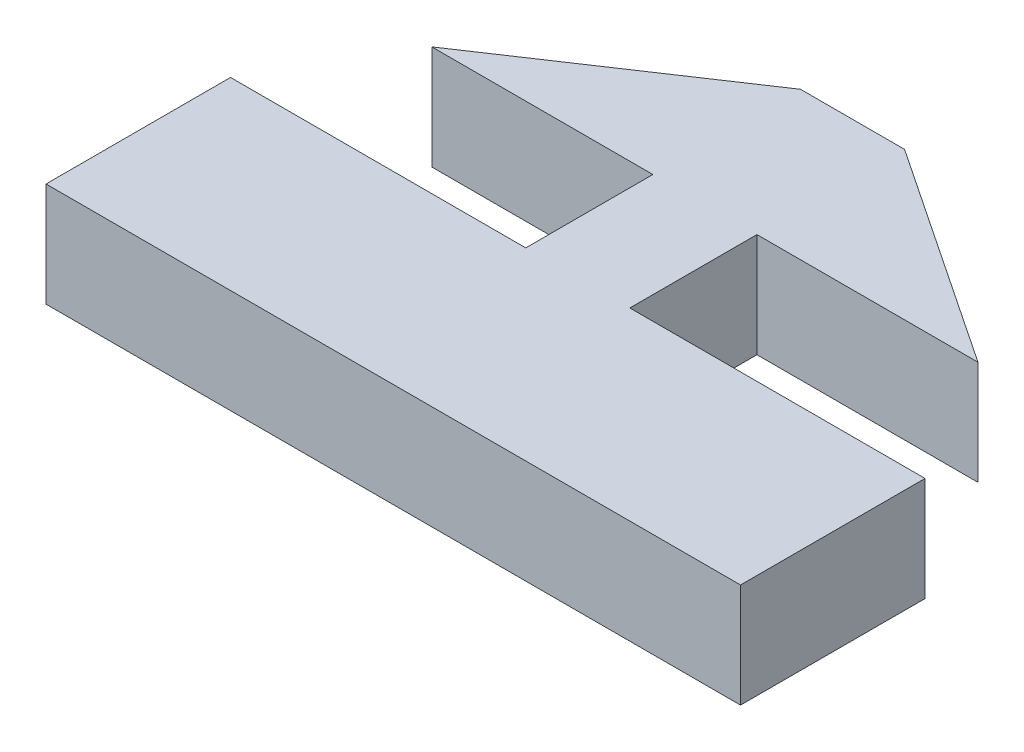
ISO-10303-21;
HEADER;
FILE_DESCRIPTION(('STEP AP214'),'2;1');
FILE_NAME('part.step','',(''),(''),'','','');
FILE_SCHEMA(('AUTOMOTIVE_DESIGN { 1 0 10303 214 1 1 1 1 }'));
ENDSEC;
DATA;
#1=APPLICATION_CONTEXT('core data for automotive mechanical design processes');
#2=APPLICATION_PROTOCOL_DEFINITION('international standard','automotive_design',2000,#1);
#3=PRODUCT_CONTEXT('',#1,'mechanical');
#4=PRODUCT('Part','Part','',(#3));
#5=PRODUCT_RELATED_PRODUCT_CATEGORY('part','',(#4));
#6=PRODUCT_DEFINITION_FORMATION('','',#4);
#7=PRODUCT_DEFINITION_CONTEXT('part definition',#1,'design');
#8=PRODUCT_DEFINITION('design','',#6,#7);
#9=PRODUCT_DEFINITION_SHAPE('','',#8);
#10=(LENGTH_UNIT() NAMED_UNIT(*) SI_UNIT(.MILLI.,.METRE.));
#11=(NAMED_UNIT(*) PLANE_ANGLE_UNIT() SI_UNIT($,.RADIAN.));
#12=(NAMED_UNIT(*) SI_UNIT($,.STERADIAN.) SOLID_ANGLE_UNIT());
#13=UNCERTAINTY_MEASURE_WITH_UNIT(LENGTH_MEASURE(1.E-05),#10,'distance_accuracy_value','');
#14=(GEOMETRIC_REPRESENTATION_CONTEXT(3) GLOBAL_UNCERTAINTY_ASSIGNED_CONTEXT((#13)) GLOBAL_UNIT_ASSIGNED_CONTEXT((#10,
#11,#12)) REPRESENTATION_CONTEXT('',''));
#15=CARTESIAN_POINT('',(0.,0.,0.));
#16=DIRECTION('',(0.,0.,1.));
#17=DIRECTION('',(1.,0.,0.));
#18=AXIS2_PLACEMENT_3D('',#15,#16,#17);
#19=CARTESIAN_POINT('',(0.,3.5814,8.5374988));
#20=DIRECTION('',(0.,0.,-1.));
#21=DIRECTION('',(-1.,0.,0.));
#22=AXIS2_PLACEMENT_3D('',#19,#20,#21);
#23=PLANE('',#22);
#24=DIRECTION('',(1.,0.,0.));
#25=VECTOR('',#24,1.);
#26=CARTESIAN_POINT('',(0.,0.,8.5374988));
#27=LINE('',#26,#25);
#28=CARTESIAN_POINT('',(-11.9507,0.,8.5374988));
#29=VERTEX_POINT('',#28);
#30=CARTESIAN_POINT('',(11.9507,0.,8.5374988));
#31=VERTEX_POINT('',#30);
#32=EDGE_CURVE('E156',#29,#31,#27,.T.);
#33=ORIENTED_EDGE('',*,*,#32,.T.);
#34=DIRECTION('',(0.,-1.,0.));
#35=VECTOR('',#34,1.);
#36=CARTESIAN_POINT('',(11.9507,3.5814,8.5374988));
#37=LINE('',#36,#35);
#38=CARTESIAN_POINT('',(11.9507,3.5814,8.5374988));
#39=VERTEX_POINT('',#38);
#40=EDGE_CURVE('E11',#39,#31,#37,.T.);
#41=ORIENTED_EDGE('',*,*,#40,.F.);
#42=DIRECTION('',(1.,0.,0.));
#43=VECTOR('',#42,1.);
#44=CARTESIAN_POINT('',(0.,3.5814,8.5374988));
#45=LINE('',#44,#43);
#46=CARTESIAN_POINT('',(-11.9507,3.5814,8.5374988));
#47=VERTEX_POINT('',#46);
#48=EDGE_CURVE('E186',#47,#39,#45,.T.);
#49=ORIENTED_EDGE('',*,*,#48,.F.);
#50=DIRECTION('',(0.,-1.,0.));
#51=VECTOR('',#50,1.);
#52=CARTESIAN_POINT('',(-11.9507,3.5814,8.5374988));
#53=LINE('',#52,#51);
#54=EDGE_CURVE('E155',#47,#29,#53,.T.);
#55=ORIENTED_EDGE('',*,*,#54,.T.);
#56=EDGE_LOOP('',(#33,#41,#49,#55));
#57=FACE_BOUND('',#56,.T.);
#58=ADVANCED_FACE('F34',(#57),#23,.F.);
#59=CARTESIAN_POINT('',(11.9507,3.5814,0.));
#60=DIRECTION('',(-1.,0.,0.));
#61=DIRECTION('',(0.,0.,1.));
#62=AXIS2_PLACEMENT_3D('',#59,#60,#61);
#63=PLANE('',#62);
#64=DIRECTION('',(0.,0.,-1.));
#65=VECTOR('',#64,1.);
#66=CARTESIAN_POINT('',(11.9507,0.,0.));
#67=LINE('',#66,#65);
#68=CARTESIAN_POINT('',(11.9507,0.,2.1874988));
#69=VERTEX_POINT('',#68);
#70=EDGE_CURVE('E159',#31,#69,#67,.T.);
#71=ORIENTED_EDGE('',*,*,#70,.T.);
#72=DIRECTION('',(0.,-1.,0.));
#73=VECTOR('',#72,1.);
#74=CARTESIAN_POINT('',(11.9507,3.5814,2.1874988));
#75=LINE('',#74,#73);
#76=CARTESIAN_POINT('',(11.9507,3.5814,2.1874988));
#77=VERTEX_POINT('',#76);
#78=EDGE_CURVE('E42',#77,#69,#75,.T.);
#79=ORIENTED_EDGE('',*,*,#78,.F.);
#80=DIRECTION('',(0.,0.,-1.));
#81=VECTOR('',#80,1.);
#82=CARTESIAN_POINT('',(11.9507,3.5814,0.));
#83=LINE('',#82,#81);
#84=EDGE_CURVE('E104',#39,#77,#83,.T.);
#85=ORIENTED_EDGE('',*,*,#84,.F.);
#86=ORIENTED_EDGE('',*,*,#40,.T.);
#87=EDGE_LOOP('',(#71,#79,#85,#86));
#88=FACE_BOUND('',#87,.T.);
#89=ADVANCED_FACE('F207',(#88),#63,.F.);
#90=CARTESIAN_POINT('',(0.,3.5814,2.1874988));
#91=DIRECTION('',(0.,0.,-1.));
#92=DIRECTION('',(-1.,0.,0.));
#93=AXIS2_PLACEMENT_3D('',#90,#91,#92);
#94=PLANE('',#93);
#95=DIRECTION('',(1.,0.,0.));
#96=VECTOR('',#95,1.);
#97=CARTESIAN_POINT('',(0.,0.,2.1874988));
#98=LINE('',#97,#96);
#99=CARTESIAN_POINT('',(1.7907,0.,2.1874988));
#100=VERTEX_POINT('',#99);
#101=EDGE_CURVE('E162',#100,#69,#98,.T.);
#102=ORIENTED_EDGE('',*,*,#101,.F.);
#103=DIRECTION('',(0.,-1.,0.));
#104=VECTOR('',#103,1.);
#105=CARTESIAN_POINT('',(1.7907,3.5814,2.1874988));
#106=LINE('',#105,#104);
#107=CARTESIAN_POINT('',(1.7907,3.5814,2.1874988));
#108=VERTEX_POINT('',#107);
#109=EDGE_CURVE('E200',#108,#100,#106,.T.);
#110=ORIENTED_EDGE('',*,*,#109,.F.);
#111=DIRECTION('',(1.,0.,0.));
#112=VECTOR('',#111,1.);
#113=CARTESIAN_POINT('',(0.,3.5814,2.1874988));
#114=LINE('',#113,#112);
#115=EDGE_CURVE('E206',#108,#77,#114,.T.);
#116=ORIENTED_EDGE('',*,*,#115,.T.);
#117=ORIENTED_EDGE('',*,*,#78,.T.);
#118=EDGE_LOOP('',(#102,#110,#116,#117));
#119=FACE_BOUND('',#118,.T.);
#120=ADVANCED_FACE('F204',(#119),#94,.T.);
#121=CARTESIAN_POINT('',(1.7907,3.5814,0.));
#122=DIRECTION('',(-1.,0.,0.));
#123=DIRECTION('',(0.,0.,1.));
#124=AXIS2_PLACEMENT_3D('',#121,#122,#123);
#125=PLANE('',#124);
#126=DIRECTION('',(0.,0.,-1.));
#127=VECTOR('',#126,1.);
#128=CARTESIAN_POINT('',(1.7907,0.,0.));
#129=LINE('',#128,#127);
#130=CARTESIAN_POINT('',(1.7907,0.,-2.1874988));
#131=VERTEX_POINT('',#130);
#132=EDGE_CURVE('E165',#100,#131,#129,.T.);
#133=ORIENTED_EDGE('',*,*,#132,.T.);
#134=DIRECTION('',(0.,-1.,0.));
#135=VECTOR('',#134,1.);
#136=CARTESIAN_POINT('',(1.7907,3.5814,-2.1874988));
#137=LINE('',#136,#135);
#138=CARTESIAN_POINT('',(1.7907,3.5814,-2.1874988));
#139=VERTEX_POINT('',#138);
#140=EDGE_CURVE('E198',#139,#131,#137,.T.);
#141=ORIENTED_EDGE('',*,*,#140,.F.);
#142=DIRECTION('',(0.,0.,-1.));
#143=VECTOR('',#142,1.);
#144=CARTESIAN_POINT('',(1.7907,3.5814,0.));
#145=LINE('',#144,#143);
#146=EDGE_CURVE('E219',#108,#139,#145,.T.);
#147=ORIENTED_EDGE('',*,*,#146,.F.);
#148=ORIENTED_EDGE('',*,*,#109,.T.);
#149=EDGE_LOOP('',(#133,#141,#147,#148));
#150=FACE_BOUND('',#149,.T.);
#151=ADVANCED_FACE('F216',(#150),#125,.F.);
#152=CARTESIAN_POINT('',(0.,3.5814,-2.1874988));
#153=DIRECTION('',(0.,0.,1.));
#154=DIRECTION('',(1.,0.,0.));
#155=AXIS2_PLACEMENT_3D('',#152,#153,#154);
#156=PLANE('',#155);
#157=DIRECTION('',(-1.,0.,0.));
#158=VECTOR('',#157,1.);
#159=CARTESIAN_POINT('',(0.,0.,-2.1874988));
#160=LINE('',#159,#158);
#161=CARTESIAN_POINT('',(9.398,0.,-2.1874988));
#162=VERTEX_POINT('',#161);
#163=EDGE_CURVE('E168',#162,#131,#160,.T.);
#164=ORIENTED_EDGE('',*,*,#163,.F.);
#165=DIRECTION('',(0.,-1.,0.));
#166=VECTOR('',#165,1.);
#167=CARTESIAN_POINT('',(9.398,3.5814,-2.1874988));
#168=LINE('',#167,#166);
#169=CARTESIAN_POINT('',(9.398,3.5814,-2.1874988));
#170=VERTEX_POINT('',#169);
#171=EDGE_CURVE('E196',#170,#162,#168,.T.);
#172=ORIENTED_EDGE('',*,*,#171,.F.);
#173=DIRECTION('',(-1.,0.,0.));
#174=VECTOR('',#173,1.);
#175=CARTESIAN_POINT('',(0.,3.5814,-2.1874988));
#176=LINE('',#175,#174);
#177=EDGE_CURVE('E221',#170,#139,#176,.T.);
#178=ORIENTED_EDGE('',*,*,#177,.T.);
#179=ORIENTED_EDGE('',*,*,#140,.T.);
#180=EDGE_LOOP('',(#164,#172,#178,#179));
#181=FACE_BOUND('',#180,.T.);
#182=ADVANCED_FACE('F266',(#181),#156,.T.);
#183=CARTESIAN_POINT('',(3.90863686168685,3.5814,-5.85318370037606));
#184=DIRECTION('',(0.55534080959066,0.,-0.831622862362014));
#185=DIRECTION('',(-0.831622862362014,0.,-0.55534080959066));
#186=AXIS2_PLACEMENT_3D('',#183,#184,#185);
#187=PLANE('',#186);
#188=DIRECTION('',(0.831622862362014,0.,0.55534080959066));
#189=VECTOR('',#188,1.);
#190=CARTESIAN_POINT('',(3.90863686168685,0.,-5.85318370037606));
#191=LINE('',#190,#189);
#192=CARTESIAN_POINT('',(1.7907,0.,-7.2674988));
#193=VERTEX_POINT('',#192);
#194=EDGE_CURVE('E171',#193,#162,#191,.T.);
#195=ORIENTED_EDGE('',*,*,#194,.F.);
#196=DIRECTION('',(0.,-1.,0.));
#197=VECTOR('',#196,1.);
#198=CARTESIAN_POINT('',(1.7907,3.5814,-7.2674988));
#199=LINE('',#198,#197);
#200=CARTESIAN_POINT('',(1.7907,3.5814,-7.2674988));
#201=VERTEX_POINT('',#200);
#202=EDGE_CURVE('E194',#201,#193,#199,.T.);
#203=ORIENTED_EDGE('',*,*,#202,.F.);
#204=DIRECTION('',(0.831622862362014,0.,0.55534080959066));
#205=VECTOR('',#204,1.);
#206=CARTESIAN_POINT('',(3.90863686168685,3.5814,-5.85318370037606));
#207=LINE('',#206,#205);
#208=EDGE_CURVE('E228',#201,#170,#207,.T.);
#209=ORIENTED_EDGE('',*,*,#208,.T.);
#210=ORIENTED_EDGE('',*,*,#171,.T.);
#211=EDGE_LOOP('',(#195,#203,#209,#210));
#212=FACE_BOUND('',#211,.T.);
#213=ADVANCED_FACE('F269',(#212),#187,.T.);
#214=CARTESIAN_POINT('',(0.,3.5814,-7.2674988));
#215=DIRECTION('',(0.,0.,-1.));
#216=DIRECTION('',(-1.,0.,0.));
#217=AXIS2_PLACEMENT_3D('',#214,#215,#216);
#218=PLANE('',#217);
#219=DIRECTION('',(1.,0.,0.));
#220=VECTOR('',#219,1.);
#221=CARTESIAN_POINT('',(0.,0.,-7.2674988));
#222=LINE('',#221,#220);
#223=CARTESIAN_POINT('',(-1.7907,0.,-7.2674988));
#224=VERTEX_POINT('',#223);
#225=EDGE_CURVE('E174',#224,#193,#222,.T.);
#226=ORIENTED_EDGE('',*,*,#225,.F.);
#227=DIRECTION('',(0.,-1.,0.));
#228=VECTOR('',#227,1.);
#229=CARTESIAN_POINT('',(-1.7907,3.5814,-7.2674988));
#230=LINE('',#229,#228);
#231=CARTESIAN_POINT('',(-1.7907,3.5814,-7.2674988));
#232=VERTEX_POINT('',#231);
#233=EDGE_CURVE('E192',#232,#224,#230,.T.);
#234=ORIENTED_EDGE('',*,*,#233,.F.);
#235=DIRECTION('',(1.,0.,0.));
#236=VECTOR('',#235,1.);
#237=CARTESIAN_POINT('',(0.,3.5814,-7.2674988));
#238=LINE('',#237,#236);
#239=EDGE_CURVE('E231',#232,#201,#238,.T.);
#240=ORIENTED_EDGE('',*,*,#239,.T.);
#241=ORIENTED_EDGE('',*,*,#202,.T.);
#242=EDGE_LOOP('',(#226,#234,#240,#241));
#243=FACE_BOUND('',#242,.T.);
#244=ADVANCED_FACE('F273',(#243),#218,.T.);
#245=CARTESIAN_POINT('',(-3.90863686168685,3.5814,-5.85318370037606));
#246=DIRECTION('',(-0.55534080959066,0.,-0.831622862362014));
#247=DIRECTION('',(-0.831622862362014,0.,0.55534080959066));
#248=AXIS2_PLACEMENT_3D('',#245,#246,#247);
#249=PLANE('',#248);
#250=DIRECTION('',(0.831622862362014,0.,-0.55534080959066));
#251=VECTOR('',#250,1.);
#252=CARTESIAN_POINT('',(-3.90863686168685,0.,-5.85318370037606));
#253=LINE('',#252,#251);
#254=CARTESIAN_POINT('',(-9.398,0.,-2.1874988));
#255=VERTEX_POINT('',#254);
#256=EDGE_CURVE('E177',#255,#224,#253,.T.);
#257=ORIENTED_EDGE('',*,*,#256,.F.);
#258=DIRECTION('',(0.,-1.,0.));
#259=VECTOR('',#258,1.);
#260=CARTESIAN_POINT('',(-9.398,3.5814,-2.1874988));
#261=LINE('',#260,#259);
#262=CARTESIAN_POINT('',(-9.398,3.5814,-2.1874988));
#263=VERTEX_POINT('',#262);
#264=EDGE_CURVE('E190',#263,#255,#261,.T.);
#265=ORIENTED_EDGE('',*,*,#264,.F.);
#266=DIRECTION('',(0.831622862362014,0.,-0.55534080959066));
#267=VECTOR('',#266,1.);
#268=CARTESIAN_POINT('',(-3.90863686168685,3.5814,-5.85318370037606));
#269=LINE('',#268,#267);
#270=EDGE_CURVE('E150',#263,#232,#269,.T.);
#271=ORIENTED_EDGE('',*,*,#270,.T.);
#272=ORIENTED_EDGE('',*,*,#233,.T.);
#273=EDGE_LOOP('',(#257,#265,#271,#272));
#274=FACE_BOUND('',#273,.T.);
#275=ADVANCED_FACE('F236',(#274),#249,.T.);
#276=CARTESIAN_POINT('',(0.,3.5814,-2.1874988));
#277=DIRECTION('',(0.,0.,1.));
#278=DIRECTION('',(1.,0.,0.));
#279=AXIS2_PLACEMENT_3D('',#276,#277,#278);
#280=PLANE('',#279);
#281=DIRECTION('',(-1.,0.,0.));
#282=VECTOR('',#281,1.);
#283=CARTESIAN_POINT('',(0.,0.,-2.1874988));
#284=LINE('',#283,#282);
#285=CARTESIAN_POINT('',(-1.7907,0.,-2.1874988));
#286=VERTEX_POINT('',#285);
#287=EDGE_CURVE('E180',#286,#255,#284,.T.);
#288=ORIENTED_EDGE('',*,*,#287,.F.);
#289=DIRECTION('',(0.,-1.,0.));
#290=VECTOR('',#289,1.);
#291=CARTESIAN_POINT('',(-1.7907,3.5814,-2.1874988));
#292=LINE('',#291,#290);
#293=CARTESIAN_POINT('',(-1.7907,3.5814,-2.1874988));
#294=VERTEX_POINT('',#293);
#295=EDGE_CURVE('E138',#294,#286,#292,.T.);
#296=ORIENTED_EDGE('',*,*,#295,.F.);
#297=DIRECTION('',(-1.,0.,0.));
#298=VECTOR('',#297,1.);
#299=CARTESIAN_POINT('',(0.,3.5814,-2.1874988));
#300=LINE('',#299,#298);
#301=EDGE_CURVE('E148',#294,#263,#300,.T.);
#302=ORIENTED_EDGE('',*,*,#301,.T.);
#303=ORIENTED_EDGE('',*,*,#264,.T.);
#304=EDGE_LOOP('',(#288,#296,#302,#303));
#305=FACE_BOUND('',#304,.T.);
#306=ADVANCED_FACE('F242',(#305),#280,.T.);
#307=CARTESIAN_POINT('',(-1.7907,3.5814,0.));
#308=DIRECTION('',(-1.,0.,0.));
#309=DIRECTION('',(0.,0.,1.));
#310=AXIS2_PLACEMENT_3D('',#307,#308,#309);
#311=PLANE('',#310);
#312=DIRECTION('',(0.,0.,-1.));
#313=VECTOR('',#312,1.);
#314=CARTESIAN_POINT('',(-1.7907,0.,0.));
#315=LINE('',#314,#313);
#316=CARTESIAN_POINT('',(-1.7907,0.,2.1874988));
#317=VERTEX_POINT('',#316);
#318=EDGE_CURVE('E137',#317,#286,#315,.T.);
#319=ORIENTED_EDGE('',*,*,#318,.F.);
#320=DIRECTION('',(0.,-1.,0.));
#321=VECTOR('',#320,1.);
#322=CARTESIAN_POINT('',(-1.7907,3.5814,2.1874988));
#323=LINE('',#322,#321);
#324=CARTESIAN_POINT('',(-1.7907,3.5814,2.1874988));
#325=VERTEX_POINT('',#324);
#326=EDGE_CURVE('E131',#325,#317,#323,.T.);
#327=ORIENTED_EDGE('',*,*,#326,.F.);
#328=DIRECTION('',(0.,0.,-1.));
#329=VECTOR('',#328,1.);
#330=CARTESIAN_POINT('',(-1.7907,3.5814,0.));
#331=LINE('',#330,#329);
#332=EDGE_CURVE('E135',#325,#294,#331,.T.);
#333=ORIENTED_EDGE('',*,*,#332,.T.);
#334=ORIENTED_EDGE('',*,*,#295,.T.);
#335=EDGE_LOOP('',(#319,#327,#333,#334));
#336=FACE_BOUND('',#335,.T.);
#337=ADVANCED_FACE('F133',(#336),#311,.T.);
#338=CARTESIAN_POINT('',(0.,3.5814,2.1874988));
#339=DIRECTION('',(0.,0.,1.));
#340=DIRECTION('',(1.,0.,0.));
#341=AXIS2_PLACEMENT_3D('',#338,#339,#340);
#342=PLANE('',#341);
#343=DIRECTION('',(-1.,0.,0.));
#344=VECTOR('',#343,1.);
#345=CARTESIAN_POINT('',(0.,0.,2.1874988));
#346=LINE('',#345,#344);
#347=CARTESIAN_POINT('',(-11.9507,0.,2.1874988));
#348=VERTEX_POINT('',#347);
#349=EDGE_CURVE('E90',#317,#348,#346,.T.);
#350=ORIENTED_EDGE('',*,*,#349,.T.);
#351=DIRECTION('',(0.,-1.,0.));
#352=VECTOR('',#351,1.);
#353=CARTESIAN_POINT('',(-11.9507,3.5814,2.1874988));
#354=LINE('',#353,#352);
#355=CARTESIAN_POINT('',(-11.9507,3.5814,2.1874988));
#356=VERTEX_POINT('',#355);
#357=EDGE_CURVE('E139',#356,#348,#354,.T.);
#358=ORIENTED_EDGE('',*,*,#357,.F.);
#359=DIRECTION('',(-1.,0.,0.));
#360=VECTOR('',#359,1.);
#361=CARTESIAN_POINT('',(0.,3.5814,2.1874988));
#362=LINE('',#361,#360);
#363=EDGE_CURVE('E141',#325,#356,#362,.T.);
#364=ORIENTED_EDGE('',*,*,#363,.F.);
#365=ORIENTED_EDGE('',*,*,#326,.T.);
#366=EDGE_LOOP('',(#350,#358,#364,#365));
#367=FACE_BOUND('',#366,.T.);
#368=ADVANCED_FACE('F142',(#367),#342,.F.);
#369=CARTESIAN_POINT('',(-11.9507,3.5814,0.));
#370=DIRECTION('',(1.,0.,0.));
#371=DIRECTION('',(0.,0.,-1.));
#372=AXIS2_PLACEMENT_3D('',#369,#370,#371);
#373=PLANE('',#372);
#374=DIRECTION('',(0.,0.,1.));
#375=VECTOR('',#374,1.);
#376=CARTESIAN_POINT('',(-11.9507,0.,0.));
#377=LINE('',#376,#375);
#378=EDGE_CURVE('E96',#348,#29,#377,.T.);
#379=ORIENTED_EDGE('',*,*,#378,.T.);
#380=ORIENTED_EDGE('',*,*,#54,.F.);
#381=DIRECTION('',(0.,0.,1.));
#382=VECTOR('',#381,1.);
#383=CARTESIAN_POINT('',(-11.9507,3.5814,0.));
#384=LINE('',#383,#382);
#385=EDGE_CURVE('E50',#356,#47,#384,.T.);
#386=ORIENTED_EDGE('',*,*,#385,.F.);
#387=ORIENTED_EDGE('',*,*,#357,.T.);
#388=EDGE_LOOP('',(#379,#380,#386,#387));
#389=FACE_BOUND('',#388,.T.);
#390=ADVANCED_FACE('F245',(#389),#373,.F.);
#391=CARTESIAN_POINT('',(0.,3.5814,0.));
#392=DIRECTION('',(0.,1.,0.));
#393=DIRECTION('',(0.,0.,1.));
#394=AXIS2_PLACEMENT_3D('',#391,#392,#393);
#395=PLANE('',#394);
#396=ORIENTED_EDGE('',*,*,#48,.T.);
#397=ORIENTED_EDGE('',*,*,#84,.T.);
#398=ORIENTED_EDGE('',*,*,#115,.F.);
#399=ORIENTED_EDGE('',*,*,#146,.T.);
#400=ORIENTED_EDGE('',*,*,#177,.F.);
#401=ORIENTED_EDGE('',*,*,#208,.F.);
#402=ORIENTED_EDGE('',*,*,#239,.F.);
#403=ORIENTED_EDGE('',*,*,#270,.F.);
#404=ORIENTED_EDGE('',*,*,#301,.F.);
#405=ORIENTED_EDGE('',*,*,#332,.F.);
#406=ORIENTED_EDGE('',*,*,#363,.T.);
#407=ORIENTED_EDGE('',*,*,#385,.T.);
#408=EDGE_LOOP('',(#396,#397,#398,#399,#400,#401,#402,#403,#404,#405,#406,#407));
#409=FACE_BOUND('',#408,.T.);
#410=ADVANCED_FACE('F145',(#409),#395,.T.);
#411=CARTESIAN_POINT('',(0.,0.,0.));
#412=DIRECTION('',(0.,1.,0.));
#413=DIRECTION('',(0.,0.,1.));
#414=AXIS2_PLACEMENT_3D('',#411,#412,#413);
#415=PLANE('',#414);
#416=ORIENTED_EDGE('',*,*,#32,.F.);
#417=ORIENTED_EDGE('',*,*,#378,.F.);
#418=ORIENTED_EDGE('',*,*,#349,.F.);
#419=ORIENTED_EDGE('',*,*,#318,.T.);
#420=ORIENTED_EDGE('',*,*,#287,.T.);
#421=ORIENTED_EDGE('',*,*,#256,.T.);
#422=ORIENTED_EDGE('',*,*,#225,.T.);
#423=ORIENTED_EDGE('',*,*,#194,.T.);
#424=ORIENTED_EDGE('',*,*,#163,.T.);
#425=ORIENTED_EDGE('',*,*,#132,.F.);
#426=ORIENTED_EDGE('',*,*,#101,.T.);
#427=ORIENTED_EDGE('',*,*,#70,.F.);
#428=EDGE_LOOP('',(#416,#417,#418,#419,#420,#421,#422,#423,#424,#425,#426,#427));
#429=FACE_BOUND('',#428,.T.);
#430=ADVANCED_FACE('F212',(#429),#415,.F.);
#431=CLOSED_SHELL('',(#58,#89,#120,#151,#182,#213,#244,#275,#306,#337,#368,#390,#410,#430));
#432=MANIFOLD_SOLID_BREP('B2',#431);
#433=ADVANCED_BREP_SHAPE_REPRESENTATION('',(#18,#432),#14);
#434=SHAPE_DEFINITION_REPRESENTATION(#9,#433);
ENDSEC;
END-ISO-10303-21;
